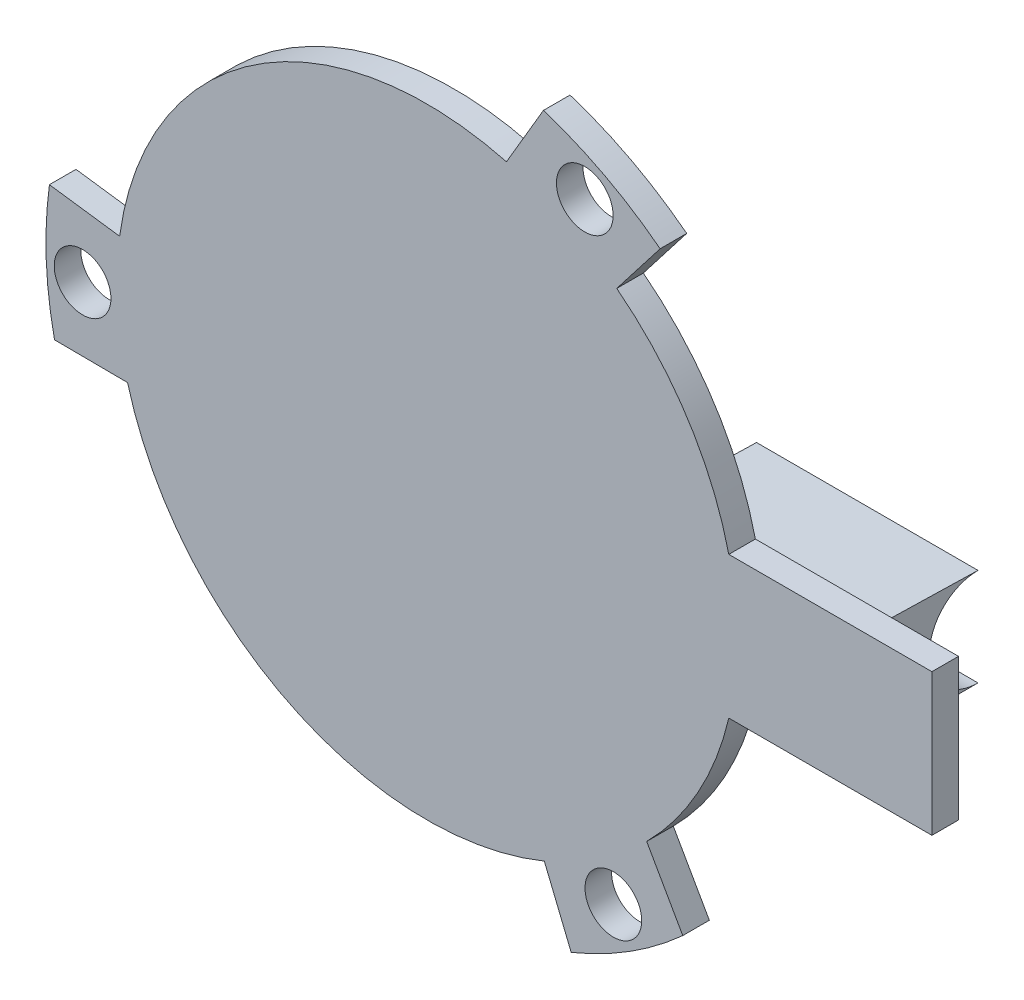
ISO-10303-21;
HEADER;
FILE_DESCRIPTION(('STEP AP214'),'2;1');
FILE_NAME('part.step','',(''),(''),'','','');
FILE_SCHEMA(('AUTOMOTIVE_DESIGN { 1 0 10303 214 1 1 1 1 }'));
ENDSEC;
DATA;
#1=APPLICATION_CONTEXT('core data for automotive mechanical design processes');
#2=APPLICATION_PROTOCOL_DEFINITION('international standard','automotive_design',2000,#1);
#3=PRODUCT_CONTEXT('',#1,'mechanical');
#4=PRODUCT('Part','Part','',(#3));
#5=PRODUCT_RELATED_PRODUCT_CATEGORY('part','',(#4));
#6=PRODUCT_DEFINITION_FORMATION('','',#4);
#7=PRODUCT_DEFINITION_CONTEXT('part definition',#1,'design');
#8=PRODUCT_DEFINITION('design','',#6,#7);
#9=PRODUCT_DEFINITION_SHAPE('','',#8);
#10=(LENGTH_UNIT() NAMED_UNIT(*) SI_UNIT(.MILLI.,.METRE.));
#11=(NAMED_UNIT(*) PLANE_ANGLE_UNIT() SI_UNIT($,.RADIAN.));
#12=(NAMED_UNIT(*) SI_UNIT($,.STERADIAN.) SOLID_ANGLE_UNIT());
#13=UNCERTAINTY_MEASURE_WITH_UNIT(LENGTH_MEASURE(1.E-05),#10,'distance_accuracy_value','');
#14=(GEOMETRIC_REPRESENTATION_CONTEXT(3) GLOBAL_UNCERTAINTY_ASSIGNED_CONTEXT((#13)) GLOBAL_UNIT_ASSIGNED_CONTEXT((#10,
#11,#12)) REPRESENTATION_CONTEXT('',''));
#15=CARTESIAN_POINT('',(0.,0.,0.));
#16=DIRECTION('',(0.,0.,1.));
#17=DIRECTION('',(1.,0.,0.));
#18=AXIS2_PLACEMENT_3D('',#15,#16,#17);
#19=CARTESIAN_POINT('',(0.,0.,1.5));
#20=DIRECTION('',(-0.134825550828024,-0.990869351046807,0.));
#21=DIRECTION('',(0.990869351046807,-0.134825550828024,0.));
#22=AXIS2_PLACEMENT_3D('',#19,#20,#21);
#23=PLANE('',#22);
#24=DIRECTION('',(-0.990869351046807,0.134825550828024,0.));
#25=VECTOR('',#24,1.);
#26=CARTESIAN_POINT('',(0.,0.,0.));
#27=LINE('',#26,#25);
#28=CARTESIAN_POINT('',(-17.3402136433191,2.35944713949042,0.));
#29=VERTEX_POINT('',#28);
#30=CARTESIAN_POINT('',(-21.3036910475063,2.89874934280251,0.));
#31=VERTEX_POINT('',#30);
#32=EDGE_CURVE('E255',#29,#31,#27,.T.);
#33=ORIENTED_EDGE('',*,*,#32,.T.);
#34=DIRECTION('',(0.,0.,-1.));
#35=VECTOR('',#34,1.);
#36=CARTESIAN_POINT('',(-21.3036910475063,2.89874934280251,1.5));
#37=LINE('',#36,#35);
#38=CARTESIAN_POINT('',(-21.3036910475063,2.89874934280251,1.5));
#39=VERTEX_POINT('',#38);
#40=EDGE_CURVE('E11',#39,#31,#37,.T.);
#41=ORIENTED_EDGE('',*,*,#40,.F.);
#42=DIRECTION('',(-0.990869351046807,0.134825550828024,0.));
#43=VECTOR('',#42,1.);
#44=CARTESIAN_POINT('',(0.,0.,1.5));
#45=LINE('',#44,#43);
#46=CARTESIAN_POINT('',(-17.3402136433191,2.35944713949042,1.5));
#47=VERTEX_POINT('',#46);
#48=EDGE_CURVE('E212',#47,#39,#45,.T.);
#49=ORIENTED_EDGE('',*,*,#48,.F.);
#50=DIRECTION('',(0.,0.,-1.));
#51=VECTOR('',#50,1.);
#52=CARTESIAN_POINT('',(-17.3402136433191,2.35944713949042,1.5));
#53=LINE('',#52,#51);
#54=EDGE_CURVE('E252',#47,#29,#53,.T.);
#55=ORIENTED_EDGE('',*,*,#54,.T.);
#56=EDGE_LOOP('',(#33,#41,#49,#55));
#57=FACE_BOUND('',#56,.T.);
#58=ADVANCED_FACE('F35',(#57),#23,.F.);
#59=CARTESIAN_POINT('',(0.,0.,1.5));
#60=DIRECTION('',(0.,0.,-1.));
#61=DIRECTION('',(-1.,0.,0.));
#62=AXIS2_PLACEMENT_3D('',#59,#60,#61);
#63=CYLINDRICAL_SURFACE('',#62,21.5);
#64=CARTESIAN_POINT('',(0.,0.,0.));
#65=DIRECTION('',(0.,0.,1.));
#66=DIRECTION('',(1.,0.,0.));
#67=AXIS2_PLACEMENT_3D('',#64,#65,#66);
#68=CIRCLE('',#67,21.5);
#69=CARTESIAN_POINT('',(-21.0152586762359,-4.53970293861725,0.));
#70=VERTEX_POINT('',#69);
#71=EDGE_CURVE('E258',#31,#70,#68,.T.);
#72=ORIENTED_EDGE('',*,*,#71,.T.);
#73=DIRECTION('',(0.,0.,-1.));
#74=VECTOR('',#73,1.);
#75=CARTESIAN_POINT('',(-21.0152586762359,-4.53970293861725,1.5));
#76=LINE('',#75,#74);
#77=CARTESIAN_POINT('',(-21.0152586762359,-4.53970293861725,1.5));
#78=VERTEX_POINT('',#77);
#79=EDGE_CURVE('E43',#78,#70,#76,.T.);
#80=ORIENTED_EDGE('',*,*,#79,.F.);
#81=CARTESIAN_POINT('',(0.,0.,1.5));
#82=DIRECTION('',(0.,0.,1.));
#83=DIRECTION('',(1.,0.,0.));
#84=AXIS2_PLACEMENT_3D('',#81,#82,#83);
#85=CIRCLE('',#84,21.5);
#86=EDGE_CURVE('E216',#39,#78,#85,.T.);
#87=ORIENTED_EDGE('',*,*,#86,.F.);
#88=ORIENTED_EDGE('',*,*,#40,.T.);
#89=EDGE_LOOP('',(#72,#80,#87,#88));
#90=FACE_BOUND('',#89,.T.);
#91=ADVANCED_FACE('F359',(#90),#63,.T.);
#92=CARTESIAN_POINT('',(-0.0333503969222485,-4.6889382106273,1.5));
#93=DIRECTION('',(0.00711238917652506,0.999974706640224,0.));
#94=DIRECTION('',(-0.999974706640224,0.00711238917652506,0.));
#95=AXIS2_PLACEMENT_3D('',#92,#93,#94);
#96=PLANE('',#95);
#97=DIRECTION('',(0.999974706640224,-0.00711238917652506,0.));
#98=VECTOR('',#97,1.);
#99=CARTESIAN_POINT('',(-0.0333503969222485,-4.6889382106273,0.));
#100=LINE('',#99,#98);
#101=CARTESIAN_POINT('',(-16.8930172521712,-4.56902266549919,0.));
#102=VERTEX_POINT('',#101);
#103=EDGE_CURVE('E260',#70,#102,#100,.T.);
#104=ORIENTED_EDGE('',*,*,#103,.T.);
#105=DIRECTION('',(0.,0.,-1.));
#106=VECTOR('',#105,1.);
#107=CARTESIAN_POINT('',(-16.8930172521712,-4.56902266549919,1.5));
#108=LINE('',#107,#106);
#109=CARTESIAN_POINT('',(-16.8930172521712,-4.56902266549919,1.5));
#110=VERTEX_POINT('',#109);
#111=EDGE_CURVE('E327',#110,#102,#108,.T.);
#112=ORIENTED_EDGE('',*,*,#111,.F.);
#113=DIRECTION('',(0.999974706640224,-0.00711238917652506,0.));
#114=VECTOR('',#113,1.);
#115=CARTESIAN_POINT('',(-0.0333503969222485,-4.6889382106273,1.5));
#116=LINE('',#115,#114);
#117=EDGE_CURVE('E218',#78,#110,#116,.T.);
#118=ORIENTED_EDGE('',*,*,#117,.F.);
#119=ORIENTED_EDGE('',*,*,#79,.T.);
#120=EDGE_LOOP('',(#104,#112,#118,#119));
#121=FACE_BOUND('',#120,.T.);
#122=ADVANCED_FACE('F334',(#121),#96,.F.);
#123=CARTESIAN_POINT('',(0.,0.,1.5));
#124=DIRECTION('',(0.,0.,-1.));
#125=DIRECTION('',(-1.,0.,0.));
#126=AXIS2_PLACEMENT_3D('',#123,#124,#125);
#127=CYLINDRICAL_SURFACE('',#126,17.5);
#128=CARTESIAN_POINT('',(0.,0.,0.));
#129=DIRECTION('',(0.,0.,1.));
#130=DIRECTION('',(1.,0.,0.));
#131=AXIS2_PLACEMENT_3D('',#128,#129,#130);
#132=CIRCLE('',#131,17.5);
#133=CARTESIAN_POINT('',(6.62676565997437,-16.1967890919091,0.));
#134=VERTEX_POINT('',#133);
#135=EDGE_CURVE('E262',#102,#134,#132,.T.);
#136=ORIENTED_EDGE('',*,*,#135,.T.);
#137=DIRECTION('',(0.,0.,-1.));
#138=VECTOR('',#137,1.);
#139=CARTESIAN_POINT('',(6.62676565997437,-16.1967890919091,1.5));
#140=LINE('',#139,#138);
#141=CARTESIAN_POINT('',(6.62676565997437,-16.1967890919091,1.5));
#142=VERTEX_POINT('',#141);
#143=EDGE_CURVE('E324',#142,#134,#140,.T.);
#144=ORIENTED_EDGE('',*,*,#143,.F.);
#145=CARTESIAN_POINT('',(0.,0.,1.5));
#146=DIRECTION('',(0.,0.,1.));
#147=DIRECTION('',(1.,0.,0.));
#148=AXIS2_PLACEMENT_3D('',#145,#146,#147);
#149=CIRCLE('',#148,17.5);
#150=EDGE_CURVE('E220',#110,#142,#149,.T.);
#151=ORIENTED_EDGE('',*,*,#150,.F.);
#152=ORIENTED_EDGE('',*,*,#111,.T.);
#153=EDGE_LOOP('',(#136,#144,#151,#152));
#154=FACE_BOUND('',#153,.T.);
#155=ADVANCED_FACE('F346',(#154),#127,.T.);
#156=CARTESIAN_POINT('',(0.,0.,1.5));
#157=DIRECTION('',(0.925530805251946,0.378672323427107,0.));
#158=DIRECTION('',(-0.378672323427107,0.925530805251947,0.));
#159=AXIS2_PLACEMENT_3D('',#156,#157,#158);
#160=PLANE('',#159);
#161=DIRECTION('',(0.378672323427107,-0.925530805251947,0.));
#162=VECTOR('',#161,1.);
#163=CARTESIAN_POINT('',(0.,0.,0.));
#164=LINE('',#163,#162);
#165=CARTESIAN_POINT('',(8.1414549536828,-19.8989123129169,0.));
#166=VERTEX_POINT('',#165);
#167=EDGE_CURVE('E264',#134,#166,#164,.T.);
#168=ORIENTED_EDGE('',*,*,#167,.T.);
#169=DIRECTION('',(0.,0.,-1.));
#170=VECTOR('',#169,1.);
#171=CARTESIAN_POINT('',(8.1414549536828,-19.8989123129169,1.5));
#172=LINE('',#171,#170);
#173=CARTESIAN_POINT('',(8.1414549536828,-19.8989123129169,1.5));
#174=VERTEX_POINT('',#173);
#175=EDGE_CURVE('E321',#174,#166,#172,.T.);
#176=ORIENTED_EDGE('',*,*,#175,.F.);
#177=DIRECTION('',(0.378672323427107,-0.925530805251947,0.));
#178=VECTOR('',#177,1.);
#179=CARTESIAN_POINT('',(0.,0.,1.5));
#180=LINE('',#179,#178);
#181=EDGE_CURVE('E222',#142,#174,#180,.T.);
#182=ORIENTED_EDGE('',*,*,#181,.F.);
#183=ORIENTED_EDGE('',*,*,#143,.T.);
#184=EDGE_LOOP('',(#168,#176,#182,#183));
#185=FACE_BOUND('',#184,.T.);
#186=ADVANCED_FACE('F350',(#185),#160,.F.);
#187=CARTESIAN_POINT('',(0.,0.,1.5));
#188=DIRECTION('',(0.,0.,-1.));
#189=DIRECTION('',(-1.,0.,0.));
#190=AXIS2_PLACEMENT_3D('',#187,#188,#189);
#191=CYLINDRICAL_SURFACE('',#190,21.5);
#192=CARTESIAN_POINT('',(0.,0.,0.));
#193=DIRECTION('',(0.,0.,1.));
#194=DIRECTION('',(1.,0.,0.));
#195=AXIS2_PLACEMENT_3D('',#192,#193,#194);
#196=CIRCLE('',#195,21.5);
#197=CARTESIAN_POINT('',(14.4391274085954,-15.929896411413,0.));
#198=VERTEX_POINT('',#197);
#199=EDGE_CURVE('E268',#166,#198,#196,.T.);
#200=ORIENTED_EDGE('',*,*,#199,.T.);
#201=DIRECTION('',(0.,0.,-1.));
#202=VECTOR('',#201,1.);
#203=CARTESIAN_POINT('',(14.4391274085954,-15.929896411413,1.5));
#204=LINE('',#203,#202);
#205=CARTESIAN_POINT('',(14.4391274085954,-15.929896411413,1.5));
#206=VERTEX_POINT('',#205);
#207=EDGE_CURVE('E318',#206,#198,#204,.T.);
#208=ORIENTED_EDGE('',*,*,#207,.F.);
#209=CARTESIAN_POINT('',(0.,0.,1.5));
#210=DIRECTION('',(0.,0.,1.));
#211=DIRECTION('',(1.,0.,0.));
#212=AXIS2_PLACEMENT_3D('',#209,#210,#211);
#213=CIRCLE('',#212,21.5);
#214=EDGE_CURVE('E226',#174,#206,#213,.T.);
#215=ORIENTED_EDGE('',*,*,#214,.F.);
#216=ORIENTED_EDGE('',*,*,#175,.T.);
#217=EDGE_LOOP('',(#200,#208,#215,#216));
#218=FACE_BOUND('',#217,.T.);
#219=ADVANCED_FACE('F430',(#218),#191,.T.);
#220=CARTESIAN_POINT('',(4.07741480563991,2.31558681435269,1.5));
#221=DIRECTION('',(-0.869559693680588,-0.49382784361164,0.));
#222=DIRECTION('',(0.49382784361164,-0.869559693680588,0.));
#223=AXIS2_PLACEMENT_3D('',#220,#221,#222);
#224=PLANE('',#223);
#225=DIRECTION('',(-0.49382784361164,0.869559693680588,0.));
#226=VECTOR('',#225,1.);
#227=CARTESIAN_POINT('',(4.07741480563991,2.31558681435269,0.));
#228=LINE('',#227,#226);
#229=CARTESIAN_POINT('',(12.4033983248748,-12.3452707541995,0.));
#230=VERTEX_POINT('',#229);
#231=EDGE_CURVE('E270',#198,#230,#228,.T.);
#232=ORIENTED_EDGE('',*,*,#231,.T.);
#233=DIRECTION('',(0.,0.,-1.));
#234=VECTOR('',#233,1.);
#235=CARTESIAN_POINT('',(12.4033983248748,-12.3452707541995,1.5));
#236=LINE('',#235,#234);
#237=CARTESIAN_POINT('',(12.4033983248748,-12.3452707541995,1.5));
#238=VERTEX_POINT('',#237);
#239=EDGE_CURVE('E315',#238,#230,#236,.T.);
#240=ORIENTED_EDGE('',*,*,#239,.F.);
#241=DIRECTION('',(-0.49382784361164,0.869559693680588,0.));
#242=VECTOR('',#241,1.);
#243=CARTESIAN_POINT('',(4.07741480563991,2.31558681435269,1.5));
#244=LINE('',#243,#242);
#245=EDGE_CURVE('E228',#206,#238,#244,.T.);
#246=ORIENTED_EDGE('',*,*,#245,.F.);
#247=ORIENTED_EDGE('',*,*,#207,.T.);
#248=EDGE_LOOP('',(#232,#240,#246,#247));
#249=FACE_BOUND('',#248,.T.);
#250=ADVANCED_FACE('F433',(#249),#224,.F.);
#251=CARTESIAN_POINT('',(17.0367250374008,-4.,0.));
#252=VERTEX_POINT('',#251);
#253=EDGE_CURVE('E266',#230,#252,#132,.T.);
#254=ORIENTED_EDGE('',*,*,#253,.T.);
#255=DIRECTION('',(0.,0.,-1.));
#256=VECTOR('',#255,1.);
#257=CARTESIAN_POINT('',(17.0367250374008,-4.,1.5));
#258=LINE('',#257,#256);
#259=CARTESIAN_POINT('',(17.0367250374008,-4.,1.5));
#260=VERTEX_POINT('',#259);
#261=EDGE_CURVE('E313',#260,#252,#258,.T.);
#262=ORIENTED_EDGE('',*,*,#261,.F.);
#263=EDGE_CURVE('E224',#238,#260,#149,.T.);
#264=ORIENTED_EDGE('',*,*,#263,.F.);
#265=ORIENTED_EDGE('',*,*,#239,.T.);
#266=EDGE_LOOP('',(#254,#262,#264,#265));
#267=FACE_BOUND('',#266,.T.);
#268=ADVANCED_FACE('F373',(#267),#127,.T.);
#269=CARTESIAN_POINT('',(0.,-4.,1.5));
#270=DIRECTION('',(0.,-1.,0.));
#271=DIRECTION('',(0.,0.,-1.));
#272=AXIS2_PLACEMENT_3D('',#269,#270,#271);
#273=PLANE('',#272);
#274=DIRECTION('',(-1.,0.,0.));
#275=VECTOR('',#274,1.);
#276=CARTESIAN_POINT('',(0.,-4.,0.));
#277=LINE('',#276,#275);
#278=CARTESIAN_POINT('',(28.5,-4.,0.));
#279=VERTEX_POINT('',#278);
#280=EDGE_CURVE('E272',#279,#252,#277,.T.);
#281=ORIENTED_EDGE('',*,*,#280,.F.);
#282=DIRECTION('',(0.,0.,-1.));
#283=VECTOR('',#282,1.);
#284=CARTESIAN_POINT('',(28.5,-4.,1.5));
#285=LINE('',#284,#283);
#286=CARTESIAN_POINT('',(28.5,-4.,1.5));
#287=VERTEX_POINT('',#286);
#288=EDGE_CURVE('E311',#287,#279,#285,.T.);
#289=ORIENTED_EDGE('',*,*,#288,.F.);
#290=DIRECTION('',(-1.,0.,0.));
#291=VECTOR('',#290,1.);
#292=CARTESIAN_POINT('',(0.,-4.,1.5));
#293=LINE('',#292,#291);
#294=EDGE_CURVE('E230',#287,#260,#293,.T.);
#295=ORIENTED_EDGE('',*,*,#294,.T.);
#296=ORIENTED_EDGE('',*,*,#261,.T.);
#297=EDGE_LOOP('',(#281,#289,#295,#296));
#298=FACE_BOUND('',#297,.T.);
#299=ADVANCED_FACE('F380',(#298),#273,.T.);
#300=CARTESIAN_POINT('',(28.5,0.,1.5));
#301=DIRECTION('',(1.,0.,0.));
#302=DIRECTION('',(0.,0.,-1.));
#303=AXIS2_PLACEMENT_3D('',#300,#301,#302);
#304=PLANE('',#303);
#305=DIRECTION('',(0.,-1.,0.));
#306=VECTOR('',#305,1.);
#307=CARTESIAN_POINT('',(28.5,0.,0.));
#308=LINE('',#307,#306);
#309=CARTESIAN_POINT('',(28.5,4.,0.));
#310=VERTEX_POINT('',#309);
#311=EDGE_CURVE('E275',#310,#279,#308,.T.);
#312=ORIENTED_EDGE('',*,*,#311,.F.);
#313=DIRECTION('',(0.,0.,-1.));
#314=VECTOR('',#313,1.);
#315=CARTESIAN_POINT('',(28.5,4.,1.5));
#316=LINE('',#315,#314);
#317=CARTESIAN_POINT('',(28.5,4.,1.5));
#318=VERTEX_POINT('',#317);
#319=EDGE_CURVE('E309',#318,#310,#316,.T.);
#320=ORIENTED_EDGE('',*,*,#319,.F.);
#321=DIRECTION('',(0.,-1.,0.));
#322=VECTOR('',#321,1.);
#323=CARTESIAN_POINT('',(28.5,0.,1.5));
#324=LINE('',#323,#322);
#325=EDGE_CURVE('E233',#318,#287,#324,.T.);
#326=ORIENTED_EDGE('',*,*,#325,.T.);
#327=ORIENTED_EDGE('',*,*,#288,.T.);
#328=EDGE_LOOP('',(#312,#320,#326,#327));
#329=FACE_BOUND('',#328,.T.);
#330=ADVANCED_FACE('F385',(#329),#304,.T.);
#331=CARTESIAN_POINT('',(0.,4.,1.5));
#332=DIRECTION('',(0.,1.,0.));
#333=DIRECTION('',(0.,0.,1.));
#334=AXIS2_PLACEMENT_3D('',#331,#332,#333);
#335=PLANE('',#334);
#336=DIRECTION('',(1.,0.,0.));
#337=VECTOR('',#336,1.);
#338=CARTESIAN_POINT('',(0.,4.,0.));
#339=LINE('',#338,#337);
#340=CARTESIAN_POINT('',(17.0367250374008,4.,0.));
#341=VERTEX_POINT('',#340);
#342=EDGE_CURVE('E278',#341,#310,#339,.T.);
#343=ORIENTED_EDGE('',*,*,#342,.F.);
#344=DIRECTION('',(0.,0.,-1.));
#345=VECTOR('',#344,1.);
#346=CARTESIAN_POINT('',(17.0367250374008,4.,1.5));
#347=LINE('',#346,#345);
#348=CARTESIAN_POINT('',(17.0367250374008,4.,1.5));
#349=VERTEX_POINT('',#348);
#350=EDGE_CURVE('E307',#349,#341,#347,.T.);
#351=ORIENTED_EDGE('',*,*,#350,.F.);
#352=DIRECTION('',(1.,0.,0.));
#353=VECTOR('',#352,1.);
#354=CARTESIAN_POINT('',(0.,4.,1.5));
#355=LINE('',#354,#353);
#356=EDGE_CURVE('E236',#349,#318,#355,.T.);
#357=ORIENTED_EDGE('',*,*,#356,.T.);
#358=ORIENTED_EDGE('',*,*,#319,.T.);
#359=EDGE_LOOP('',(#343,#351,#357,#358));
#360=FACE_BOUND('',#359,.T.);
#361=ADVANCED_FACE('F388',(#360),#335,.T.);
#362=CARTESIAN_POINT('',(10.7134479833448,13.8373419524187,0.));
#363=VERTEX_POINT('',#362);
#364=EDGE_CURVE('E281',#341,#363,#132,.T.);
#365=ORIENTED_EDGE('',*,*,#364,.T.);
#366=DIRECTION('',(0.,0.,-1.));
#367=VECTOR('',#366,1.);
#368=CARTESIAN_POINT('',(10.7134479833448,13.8373419524187,1.5));
#369=LINE('',#368,#367);
#370=CARTESIAN_POINT('',(10.7134479833448,13.8373419524187,1.5));
#371=VERTEX_POINT('',#370);
#372=EDGE_CURVE('E304',#371,#363,#369,.T.);
#373=ORIENTED_EDGE('',*,*,#372,.F.);
#374=EDGE_CURVE('E239',#349,#371,#149,.T.);
#375=ORIENTED_EDGE('',*,*,#374,.F.);
#376=ORIENTED_EDGE('',*,*,#350,.T.);
#377=EDGE_LOOP('',(#365,#373,#375,#376));
#378=FACE_BOUND('',#377,.T.);
#379=ADVANCED_FACE('F392',(#378),#127,.T.);
#380=CARTESIAN_POINT('',(0.,0.,1.5));
#381=DIRECTION('',(-0.790705254423924,0.612197027619701,0.));
#382=DIRECTION('',(-0.612197027619701,-0.790705254423924,0.));
#383=AXIS2_PLACEMENT_3D('',#380,#381,#382);
#384=PLANE('',#383);
#385=DIRECTION('',(0.612197027619701,0.790705254423924,0.));
#386=VECTOR('',#385,1.);
#387=CARTESIAN_POINT('',(0.,0.,0.));
#388=LINE('',#387,#386);
#389=CARTESIAN_POINT('',(13.1622360938236,17.0001629701144,0.));
#390=VERTEX_POINT('',#389);
#391=EDGE_CURVE('E282',#363,#390,#388,.T.);
#392=ORIENTED_EDGE('',*,*,#391,.T.);
#393=DIRECTION('',(0.,0.,-1.));
#394=VECTOR('',#393,1.);
#395=CARTESIAN_POINT('',(13.1622360938236,17.0001629701144,1.5));
#396=LINE('',#395,#394);
#397=CARTESIAN_POINT('',(13.1622360938236,17.0001629701144,1.5));
#398=VERTEX_POINT('',#397);
#399=EDGE_CURVE('E301',#398,#390,#396,.T.);
#400=ORIENTED_EDGE('',*,*,#399,.F.);
#401=DIRECTION('',(0.612197027619701,0.790705254423924,0.));
#402=VECTOR('',#401,1.);
#403=CARTESIAN_POINT('',(0.,0.,1.5));
#404=LINE('',#403,#402);
#405=EDGE_CURVE('E240',#371,#398,#404,.T.);
#406=ORIENTED_EDGE('',*,*,#405,.F.);
#407=ORIENTED_EDGE('',*,*,#372,.T.);
#408=EDGE_LOOP('',(#392,#400,#406,#407));
#409=FACE_BOUND('',#408,.T.);
#410=ADVANCED_FACE('F395',(#409),#384,.F.);
#411=CARTESIAN_POINT('',(0.,0.,1.5));
#412=DIRECTION('',(0.,0.,-1.));
#413=DIRECTION('',(-1.,0.,0.));
#414=AXIS2_PLACEMENT_3D('',#411,#412,#413);
#415=CYLINDRICAL_SURFACE('',#414,21.5);
#416=CARTESIAN_POINT('',(0.,0.,0.));
#417=DIRECTION('',(0.,0.,1.));
#418=DIRECTION('',(1.,0.,0.));
#419=AXIS2_PLACEMENT_3D('',#416,#417,#418);
#420=CIRCLE('',#419,21.5);
#421=CARTESIAN_POINT('',(6.57613126764058,20.4695993500303,0.));
#422=VERTEX_POINT('',#421);
#423=EDGE_CURVE('E284',#390,#422,#420,.T.);
#424=ORIENTED_EDGE('',*,*,#423,.T.);
#425=DIRECTION('',(0.,0.,-1.));
#426=VECTOR('',#425,1.);
#427=CARTESIAN_POINT('',(6.57613126764058,20.4695993500303,1.5));
#428=LINE('',#427,#426);
#429=CARTESIAN_POINT('',(6.57613126764058,20.4695993500303,1.5));
#430=VERTEX_POINT('',#429);
#431=EDGE_CURVE('E298',#430,#422,#428,.T.);
#432=ORIENTED_EDGE('',*,*,#431,.F.);
#433=CARTESIAN_POINT('',(0.,0.,1.5));
#434=DIRECTION('',(0.,0.,1.));
#435=DIRECTION('',(1.,0.,0.));
#436=AXIS2_PLACEMENT_3D('',#433,#434,#435);
#437=CIRCLE('',#436,21.5);
#438=EDGE_CURVE('E242',#398,#430,#437,.T.);
#439=ORIENTED_EDGE('',*,*,#438,.F.);
#440=ORIENTED_EDGE('',*,*,#399,.T.);
#441=EDGE_LOOP('',(#424,#432,#439,#440));
#442=FACE_BOUND('',#441,.T.);
#443=ADVANCED_FACE('F399',(#442),#415,.T.);
#444=CARTESIAN_POINT('',(-4.04406440871767,2.37335139627461,1.5));
#445=DIRECTION('',(0.862447304504063,-0.506146863028584,0.));
#446=DIRECTION('',(0.506146863028584,0.862447304504063,0.));
#447=AXIS2_PLACEMENT_3D('',#444,#445,#446);
#448=PLANE('',#447);
#449=DIRECTION('',(-0.506146863028584,-0.862447304504063,0.));
#450=VECTOR('',#449,1.);
#451=CARTESIAN_POINT('',(-4.04406440871767,2.37335139627461,0.));
#452=LINE('',#451,#450);
#453=CARTESIAN_POINT('',(4.48961892729644,16.9142934196987,0.));
#454=VERTEX_POINT('',#453);
#455=EDGE_CURVE('E286',#422,#454,#452,.T.);
#456=ORIENTED_EDGE('',*,*,#455,.T.);
#457=DIRECTION('',(0.,0.,-1.));
#458=VECTOR('',#457,1.);
#459=CARTESIAN_POINT('',(4.48961892729644,16.9142934196987,1.5));
#460=LINE('',#459,#458);
#461=CARTESIAN_POINT('',(4.48961892729644,16.9142934196987,1.5));
#462=VERTEX_POINT('',#461);
#463=EDGE_CURVE('E295',#462,#454,#460,.T.);
#464=ORIENTED_EDGE('',*,*,#463,.F.);
#465=DIRECTION('',(-0.506146863028584,-0.862447304504063,0.));
#466=VECTOR('',#465,1.);
#467=CARTESIAN_POINT('',(-4.04406440871767,2.37335139627461,1.5));
#468=LINE('',#467,#466);
#469=EDGE_CURVE('E244',#430,#462,#468,.T.);
#470=ORIENTED_EDGE('',*,*,#469,.F.);
#471=ORIENTED_EDGE('',*,*,#431,.T.);
#472=EDGE_LOOP('',(#456,#464,#470,#471));
#473=FACE_BOUND('',#472,.T.);
#474=ADVANCED_FACE('F404',(#473),#448,.F.);
#475=CARTESIAN_POINT('',(8.9098145605786,17.2938088805019,1.5));
#476=DIRECTION('',(0.,0.,-1.));
#477=DIRECTION('',(-1.,0.,0.));
#478=AXIS2_PLACEMENT_3D('',#475,#476,#477);
#479=CYLINDRICAL_SURFACE('',#478,1.59999999999848);
#480=CARTESIAN_POINT('',(8.9098145605786,17.2938088805019,1.5));
#481=DIRECTION('',(0.,0.,1.));
#482=DIRECTION('',(1.,0.,0.));
#483=AXIS2_PLACEMENT_3D('',#480,#481,#482);
#484=CIRCLE('',#483,1.59999999999848);
#485=CARTESIAN_POINT('',(10.5098145605771,17.2938088805019,1.5));
#486=VERTEX_POINT('',#485);
#487=EDGE_CURVE('E246',#486,#486,#484,.T.);
#488=ORIENTED_EDGE('',*,*,#487,.T.);
#489=EDGE_LOOP('',(#488));
#490=FACE_BOUND('',#489,.T.);
#491=CARTESIAN_POINT('',(8.9098145605786,17.2938088805019,0.));
#492=DIRECTION('',(0.,0.,1.));
#493=DIRECTION('',(1.,0.,0.));
#494=AXIS2_PLACEMENT_3D('',#491,#492,#493);
#495=CIRCLE('',#494,1.59999999999848);
#496=CARTESIAN_POINT('',(10.5098145605771,17.2938088805019,0.));
#497=VERTEX_POINT('',#496);
#498=EDGE_CURVE('E288',#497,#497,#495,.T.);
#499=ORIENTED_EDGE('',*,*,#498,.F.);
#500=EDGE_LOOP('',(#499));
#501=FACE_BOUND('',#500,.T.);
#502=ADVANCED_FACE('F407',(#490,#501),#479,.F.);
#503=EDGE_CURVE('E265',#454,#29,#132,.T.);
#504=ORIENTED_EDGE('',*,*,#503,.T.);
#505=ORIENTED_EDGE('',*,*,#54,.F.);
#506=EDGE_CURVE('E223',#462,#47,#149,.T.);
#507=ORIENTED_EDGE('',*,*,#506,.F.);
#508=ORIENTED_EDGE('',*,*,#463,.T.);
#509=EDGE_LOOP('',(#504,#505,#507,#508));
#510=FACE_BOUND('',#509,.T.);
#511=ADVANCED_FACE('F405',(#510),#127,.T.);
#512=CARTESIAN_POINT('',(-19.4317850989961,-0.930778687782604,1.5));
#513=DIRECTION('',(0.,0.,-1.));
#514=DIRECTION('',(-1.,0.,0.));
#515=AXIS2_PLACEMENT_3D('',#512,#513,#514);
#516=CYLINDRICAL_SURFACE('',#515,1.6);
#517=CARTESIAN_POINT('',(-19.4317850989961,-0.930778687782604,1.5));
#518=DIRECTION('',(0.,0.,1.));
#519=DIRECTION('',(1.,0.,0.));
#520=AXIS2_PLACEMENT_3D('',#517,#518,#519);
#521=CIRCLE('',#520,1.6);
#522=CARTESIAN_POINT('',(-17.8317850989961,-0.930778687782604,1.5));
#523=VERTEX_POINT('',#522);
#524=EDGE_CURVE('E209',#523,#523,#521,.T.);
#525=ORIENTED_EDGE('',*,*,#524,.T.);
#526=EDGE_LOOP('',(#525));
#527=FACE_BOUND('',#526,.T.);
#528=CARTESIAN_POINT('',(-19.4317850989961,-0.930778687782604,0.));
#529=DIRECTION('',(0.,0.,1.));
#530=DIRECTION('',(1.,0.,0.));
#531=AXIS2_PLACEMENT_3D('',#528,#529,#530);
#532=CIRCLE('',#531,1.6);
#533=CARTESIAN_POINT('',(-17.8317850989961,-0.930778687782604,0.));
#534=VERTEX_POINT('',#533);
#535=EDGE_CURVE('E188',#534,#534,#532,.T.);
#536=ORIENTED_EDGE('',*,*,#535,.F.);
#537=EDGE_LOOP('',(#536));
#538=FACE_BOUND('',#537,.T.);
#539=ADVANCED_FACE('F37',(#527,#538),#516,.F.);
#540=CARTESIAN_POINT('',(10.5219705384197,-16.3630301927204,1.5));
#541=DIRECTION('',(0.,0.,-1.));
#542=DIRECTION('',(-1.,0.,0.));
#543=AXIS2_PLACEMENT_3D('',#540,#541,#542);
#544=CYLINDRICAL_SURFACE('',#543,1.59999999999893);
#545=CARTESIAN_POINT('',(10.5219705384197,-16.3630301927204,1.5));
#546=DIRECTION('',(0.,0.,1.));
#547=DIRECTION('',(1.,0.,0.));
#548=AXIS2_PLACEMENT_3D('',#545,#546,#547);
#549=CIRCLE('',#548,1.59999999999893);
#550=CARTESIAN_POINT('',(12.1219705384186,-16.3630301927204,1.5));
#551=VERTEX_POINT('',#550);
#552=EDGE_CURVE('E249',#551,#551,#549,.T.);
#553=ORIENTED_EDGE('',*,*,#552,.T.);
#554=EDGE_LOOP('',(#553));
#555=FACE_BOUND('',#554,.T.);
#556=CARTESIAN_POINT('',(10.5219705384197,-16.3630301927204,0.));
#557=DIRECTION('',(0.,0.,1.));
#558=DIRECTION('',(1.,0.,0.));
#559=AXIS2_PLACEMENT_3D('',#556,#557,#558);
#560=CIRCLE('',#559,1.59999999999893);
#561=CARTESIAN_POINT('',(12.1219705384186,-16.3630301927204,0.));
#562=VERTEX_POINT('',#561);
#563=EDGE_CURVE('E213',#562,#562,#560,.T.);
#564=ORIENTED_EDGE('',*,*,#563,.F.);
#565=EDGE_LOOP('',(#564));
#566=FACE_BOUND('',#565,.T.);
#567=ADVANCED_FACE('F413',(#555,#566),#544,.F.);
#568=CARTESIAN_POINT('',(0.,0.,1.5));
#569=DIRECTION('',(0.,0.,1.));
#570=DIRECTION('',(1.,0.,0.));
#571=AXIS2_PLACEMENT_3D('',#568,#569,#570);
#572=PLANE('',#571);
#573=ORIENTED_EDGE('',*,*,#524,.F.);
#574=EDGE_LOOP('',(#573));
#575=FACE_BOUND('',#574,.T.);
#576=ORIENTED_EDGE('',*,*,#48,.T.);
#577=ORIENTED_EDGE('',*,*,#86,.T.);
#578=ORIENTED_EDGE('',*,*,#117,.T.);
#579=ORIENTED_EDGE('',*,*,#150,.T.);
#580=ORIENTED_EDGE('',*,*,#181,.T.);
#581=ORIENTED_EDGE('',*,*,#214,.T.);
#582=ORIENTED_EDGE('',*,*,#245,.T.);
#583=ORIENTED_EDGE('',*,*,#263,.T.);
#584=ORIENTED_EDGE('',*,*,#294,.F.);
#585=ORIENTED_EDGE('',*,*,#325,.F.);
#586=ORIENTED_EDGE('',*,*,#356,.F.);
#587=ORIENTED_EDGE('',*,*,#374,.T.);
#588=ORIENTED_EDGE('',*,*,#405,.T.);
#589=ORIENTED_EDGE('',*,*,#438,.T.);
#590=ORIENTED_EDGE('',*,*,#469,.T.);
#591=ORIENTED_EDGE('',*,*,#506,.T.);
#592=EDGE_LOOP('',(#576,#577,#578,#579,#580,#581,#582,#583,#584,#585,#586,#587,#588,#589,#590,#591));
#593=FACE_BOUND('',#592,.T.);
#594=ORIENTED_EDGE('',*,*,#487,.F.);
#595=EDGE_LOOP('',(#594));
#596=FACE_BOUND('',#595,.T.);
#597=ORIENTED_EDGE('',*,*,#552,.F.);
#598=EDGE_LOOP('',(#597));
#599=FACE_BOUND('',#598,.T.);
#600=ADVANCED_FACE('F354',(#575,#593,#596,#599),#572,.T.);
#601=CARTESIAN_POINT('',(0.,0.,0.));
#602=DIRECTION('',(0.,0.,1.));
#603=DIRECTION('',(1.,0.,0.));
#604=AXIS2_PLACEMENT_3D('',#601,#602,#603);
#605=PLANE('',#604);
#606=DIRECTION('',(1.,0.,0.));
#607=VECTOR('',#606,1.);
#608=CARTESIAN_POINT('',(11.1,2.89874934280251,0.));
#609=LINE('',#608,#607);
#610=CARTESIAN_POINT('',(11.1,2.89874934280251,0.));
#611=VERTEX_POINT('',#610);
#612=CARTESIAN_POINT('',(23.6,2.89874934280251,0.));
#613=VERTEX_POINT('',#612);
#614=EDGE_CURVE('E50',#611,#613,#609,.T.);
#615=ORIENTED_EDGE('',*,*,#614,.F.);
#616=DIRECTION('',(0.,-1.,0.));
#617=VECTOR('',#616,1.);
#618=CARTESIAN_POINT('',(11.1,0.,0.));
#619=LINE('',#618,#617);
#620=CARTESIAN_POINT('',(11.1,-2.75295714793858,0.));
#621=VERTEX_POINT('',#620);
#622=EDGE_CURVE('E55',#611,#621,#619,.T.);
#623=ORIENTED_EDGE('',*,*,#622,.T.);
#624=DIRECTION('',(1.,0.,0.));
#625=VECTOR('',#624,1.);
#626=CARTESIAN_POINT('',(11.1,-2.75295714793858,0.));
#627=LINE('',#626,#625);
#628=CARTESIAN_POINT('',(23.6,-2.75295714793858,0.));
#629=VERTEX_POINT('',#628);
#630=EDGE_CURVE('E206',#621,#629,#627,.T.);
#631=ORIENTED_EDGE('',*,*,#630,.T.);
#632=DIRECTION('',(0.,-1.,0.));
#633=VECTOR('',#632,1.);
#634=CARTESIAN_POINT('',(23.6,0.,0.));
#635=LINE('',#634,#633);
#636=EDGE_CURVE('E178',#613,#629,#635,.T.);
#637=ORIENTED_EDGE('',*,*,#636,.F.);
#638=EDGE_LOOP('',(#615,#623,#631,#637));
#639=FACE_BOUND('',#638,.T.);
#640=ORIENTED_EDGE('',*,*,#535,.T.);
#641=EDGE_LOOP('',(#640));
#642=FACE_BOUND('',#641,.T.);
#643=ORIENTED_EDGE('',*,*,#32,.F.);
#644=ORIENTED_EDGE('',*,*,#503,.F.);
#645=ORIENTED_EDGE('',*,*,#455,.F.);
#646=ORIENTED_EDGE('',*,*,#423,.F.);
#647=ORIENTED_EDGE('',*,*,#391,.F.);
#648=ORIENTED_EDGE('',*,*,#364,.F.);
#649=ORIENTED_EDGE('',*,*,#342,.T.);
#650=ORIENTED_EDGE('',*,*,#311,.T.);
#651=ORIENTED_EDGE('',*,*,#280,.T.);
#652=ORIENTED_EDGE('',*,*,#253,.F.);
#653=ORIENTED_EDGE('',*,*,#231,.F.);
#654=ORIENTED_EDGE('',*,*,#199,.F.);
#655=ORIENTED_EDGE('',*,*,#167,.F.);
#656=ORIENTED_EDGE('',*,*,#135,.F.);
#657=ORIENTED_EDGE('',*,*,#103,.F.);
#658=ORIENTED_EDGE('',*,*,#71,.F.);
#659=EDGE_LOOP('',(#643,#644,#645,#646,#647,#648,#649,#650,#651,#652,#653,#654,#655,#656,#657,#658));
#660=FACE_BOUND('',#659,.T.);
#661=ORIENTED_EDGE('',*,*,#498,.T.);
#662=EDGE_LOOP('',(#661));
#663=FACE_BOUND('',#662,.T.);
#664=ORIENTED_EDGE('',*,*,#563,.T.);
#665=EDGE_LOOP('',(#664));
#666=FACE_BOUND('',#665,.T.);
#667=ADVANCED_FACE('F340',(#639,#642,#660,#663,#666),#605,.F.);
#668=CARTESIAN_POINT('',(11.1,2.64920551331488,-10.0656779298424));
#669=DIRECTION('',(0.,-0.999692830934681,0.0247839419343194));
#670=DIRECTION('',(0.,-0.0247839419343195,-0.999692830934681));
#671=AXIS2_PLACEMENT_3D('',#668,#669,#670);
#672=PLANE('',#671);
#673=DIRECTION('',(0.,-0.0247839419343194,-0.999692830934681));
#674=VECTOR('',#673,1.);
#675=CARTESIAN_POINT('',(23.6,2.64920551331488,-10.0656779298424));
#676=LINE('',#675,#674);
#677=CARTESIAN_POINT('',(23.6,2.75,-6.));
#678=VERTEX_POINT('',#677);
#679=EDGE_CURVE('E184',#613,#678,#676,.T.);
#680=ORIENTED_EDGE('',*,*,#679,.T.);
#681=DIRECTION('',(1.,0.,0.));
#682=VECTOR('',#681,1.);
#683=CARTESIAN_POINT('',(11.1,2.75,-6.));
#684=LINE('',#683,#682);
#685=CARTESIAN_POINT('',(11.1,2.75,-6.));
#686=VERTEX_POINT('',#685);
#687=EDGE_CURVE('E181',#686,#678,#684,.T.);
#688=ORIENTED_EDGE('',*,*,#687,.F.);
#689=DIRECTION('',(0.,-0.0247839419343194,-0.999692830934681));
#690=VECTOR('',#689,1.);
#691=CARTESIAN_POINT('',(11.1,2.64920551331488,-10.0656779298424));
#692=LINE('',#691,#690);
#693=EDGE_CURVE('E170',#611,#686,#692,.T.);
#694=ORIENTED_EDGE('',*,*,#693,.F.);
#695=ORIENTED_EDGE('',*,*,#614,.T.);
#696=EDGE_LOOP('',(#680,#688,#694,#695));
#697=FACE_BOUND('',#696,.T.);
#698=ADVANCED_FACE('F182',(#697),#672,.F.);
#699=CARTESIAN_POINT('',(11.1,0.,-6.));
#700=DIRECTION('',(1.,0.,0.));
#701=DIRECTION('',(0.,0.,-1.));
#702=AXIS2_PLACEMENT_3D('',#699,#700,#701);
#703=CYLINDRICAL_SURFACE('',#702,2.75);
#704=CARTESIAN_POINT('',(23.6,0.,-6.));
#705=DIRECTION('',(-1.,0.,0.));
#706=DIRECTION('',(0.,0.,1.));
#707=AXIS2_PLACEMENT_3D('',#704,#705,#706);
#708=CIRCLE('',#707,2.75);
#709=CARTESIAN_POINT('',(23.6,-2.75,-6.));
#710=VERTEX_POINT('',#709);
#711=EDGE_CURVE('E198',#710,#678,#708,.T.);
#712=ORIENTED_EDGE('',*,*,#711,.F.);
#713=DIRECTION('',(1.,0.,0.));
#714=VECTOR('',#713,1.);
#715=CARTESIAN_POINT('',(11.1,-2.75,-6.));
#716=LINE('',#715,#714);
#717=CARTESIAN_POINT('',(11.1,-2.75,-6.));
#718=VERTEX_POINT('',#717);
#719=EDGE_CURVE('E189',#718,#710,#716,.T.);
#720=ORIENTED_EDGE('',*,*,#719,.F.);
#721=CARTESIAN_POINT('',(11.1,0.,-6.));
#722=DIRECTION('',(-1.,0.,0.));
#723=DIRECTION('',(0.,0.,1.));
#724=AXIS2_PLACEMENT_3D('',#721,#722,#723);
#725=CIRCLE('',#724,2.75);
#726=EDGE_CURVE('E175',#718,#686,#725,.T.);
#727=ORIENTED_EDGE('',*,*,#726,.T.);
#728=ORIENTED_EDGE('',*,*,#687,.T.);
#729=EDGE_LOOP('',(#712,#720,#727,#728));
#730=FACE_BOUND('',#729,.T.);
#731=ADVANCED_FACE('F191',(#730),#703,.F.);
#732=CARTESIAN_POINT('',(11.1,-2.74802790052024,-10.0013543875069));
#733=DIRECTION('',(0.,-0.999999878545523,-0.00049285792990328));
#734=DIRECTION('',(0.,0.00049285792990328,-0.999999878545523));
#735=AXIS2_PLACEMENT_3D('',#732,#733,#734);
#736=PLANE('',#735);
#737=DIRECTION('',(0.,0.00049285792990328,-0.999999878545523));
#738=VECTOR('',#737,1.);
#739=CARTESIAN_POINT('',(23.6,-2.74802790052024,-10.0013543875069));
#740=LINE('',#739,#738);
#741=EDGE_CURVE('E200',#629,#710,#740,.T.);
#742=ORIENTED_EDGE('',*,*,#741,.F.);
#743=ORIENTED_EDGE('',*,*,#630,.F.);
#744=DIRECTION('',(0.,0.00049285792990328,-0.999999878545523));
#745=VECTOR('',#744,1.);
#746=CARTESIAN_POINT('',(11.1,-2.74802790052024,-10.0013543875069));
#747=LINE('',#746,#745);
#748=EDGE_CURVE('E192',#621,#718,#747,.T.);
#749=ORIENTED_EDGE('',*,*,#748,.T.);
#750=ORIENTED_EDGE('',*,*,#719,.T.);
#751=EDGE_LOOP('',(#742,#743,#749,#750));
#752=FACE_BOUND('',#751,.T.);
#753=ADVANCED_FACE('F515',(#752),#736,.T.);
#754=CARTESIAN_POINT('',(11.1,0.,-6.));
#755=DIRECTION('',(-1.,0.,0.));
#756=DIRECTION('',(0.,0.,1.));
#757=AXIS2_PLACEMENT_3D('',#754,#755,#756);
#758=PLANE('',#757);
#759=ORIENTED_EDGE('',*,*,#693,.T.);
#760=ORIENTED_EDGE('',*,*,#726,.F.);
#761=ORIENTED_EDGE('',*,*,#748,.F.);
#762=ORIENTED_EDGE('',*,*,#622,.F.);
#763=EDGE_LOOP('',(#759,#760,#761,#762));
#764=FACE_BOUND('',#763,.T.);
#765=ADVANCED_FACE('F172',(#764),#758,.T.);
#766=CARTESIAN_POINT('',(23.6,0.,-6.));
#767=DIRECTION('',(-1.,0.,0.));
#768=DIRECTION('',(0.,0.,1.));
#769=AXIS2_PLACEMENT_3D('',#766,#767,#768);
#770=PLANE('',#769);
#771=ORIENTED_EDGE('',*,*,#679,.F.);
#772=ORIENTED_EDGE('',*,*,#636,.T.);
#773=ORIENTED_EDGE('',*,*,#741,.T.);
#774=ORIENTED_EDGE('',*,*,#711,.T.);
#775=EDGE_LOOP('',(#771,#772,#773,#774));
#776=FACE_BOUND('',#775,.T.);
#777=ADVANCED_FACE('F533',(#776),#770,.F.);
#778=CLOSED_SHELL('',(#58,#91,#122,#155,#186,#219,#250,#268,#299,#330,#361,#379,#410,#443,#474,
#502,#511,#539,#567,#600,#667,#698,#731,#753,#765,#777));
#779=MANIFOLD_SOLID_BREP('B2',#778);
#780=ADVANCED_BREP_SHAPE_REPRESENTATION('',(#18,#779),#14);
#781=SHAPE_DEFINITION_REPRESENTATION(#9,#780);
ENDSEC;
END-ISO-10303-21;
